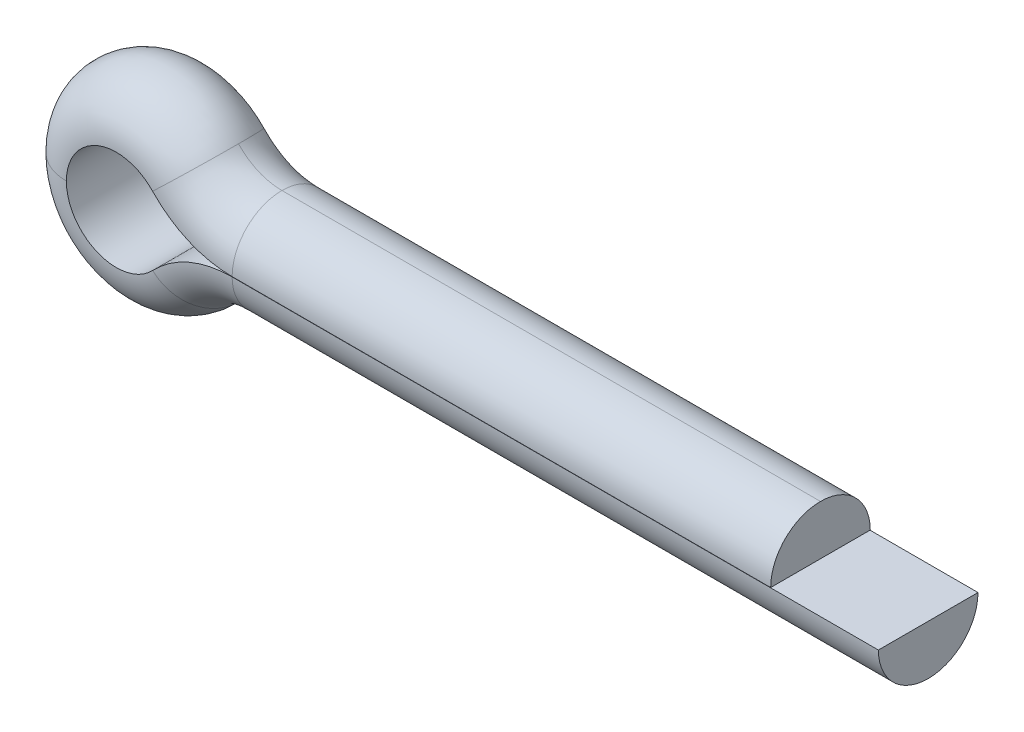
ISO-10303-21;
HEADER;
FILE_DESCRIPTION(('STEP AP214'),'2;1');
FILE_NAME('part.step','',(''),(''),'','','');
FILE_SCHEMA(('AUTOMOTIVE_DESIGN { 1 0 10303 214 1 1 1 1 }'));
ENDSEC;
DATA;
#1=APPLICATION_CONTEXT('core data for automotive mechanical design processes');
#2=APPLICATION_PROTOCOL_DEFINITION('international standard','automotive_design',2000,#1);
#3=PRODUCT_CONTEXT('',#1,'mechanical');
#4=PRODUCT('Part','Part','',(#3));
#5=PRODUCT_RELATED_PRODUCT_CATEGORY('part','',(#4));
#6=PRODUCT_DEFINITION_FORMATION('','',#4);
#7=PRODUCT_DEFINITION_CONTEXT('part definition',#1,'design');
#8=PRODUCT_DEFINITION('design','',#6,#7);
#9=PRODUCT_DEFINITION_SHAPE('','',#8);
#10=(LENGTH_UNIT() NAMED_UNIT(*) SI_UNIT(.MILLI.,.METRE.));
#11=(NAMED_UNIT(*) PLANE_ANGLE_UNIT() SI_UNIT($,.RADIAN.));
#12=(NAMED_UNIT(*) SI_UNIT($,.STERADIAN.) SOLID_ANGLE_UNIT());
#13=UNCERTAINTY_MEASURE_WITH_UNIT(LENGTH_MEASURE(1.E-05),#10,'distance_accuracy_value','');
#14=(GEOMETRIC_REPRESENTATION_CONTEXT(3) GLOBAL_UNCERTAINTY_ASSIGNED_CONTEXT((#13)) GLOBAL_UNIT_ASSIGNED_CONTEXT((#10,
#11,#12)) REPRESENTATION_CONTEXT('',''));
#15=CARTESIAN_POINT('',(0.,0.,0.));
#16=DIRECTION('',(0.,0.,1.));
#17=DIRECTION('',(1.,0.,0.));
#18=AXIS2_PLACEMENT_3D('',#15,#16,#17);
#19=CARTESIAN_POINT('',(32.,0.,0.));
#20=DIRECTION('',(-1.,0.,0.));
#21=DIRECTION('',(0.,1.,0.));
#22=AXIS2_PLACEMENT_3D('',#19,#20,#21);
#23=PLANE('',#22);
#24=CARTESIAN_POINT('',(32.,0.,0.));
#25=DIRECTION('',(-1.,0.,0.));
#26=DIRECTION('',(0.,0.,-1.));
#27=AXIS2_PLACEMENT_3D('',#24,#25,#26);
#28=CIRCLE('',#27,1.85);
#29=CARTESIAN_POINT('',(32.,-0.00499999999999806,-1.8499932432309));
#30=VERTEX_POINT('',#29);
#31=CARTESIAN_POINT('',(32.,-0.00499999999999806,1.8499932432309));
#32=VERTEX_POINT('',#31);
#33=EDGE_CURVE('E27',#30,#32,#28,.T.);
#34=ORIENTED_EDGE('',*,*,#33,.F.);
#35=DIRECTION('',(0.,0.,-1.));
#36=VECTOR('',#35,1.);
#37=CARTESIAN_POINT('',(32.,-0.00499999999999806,-1.8499932432309));
#38=LINE('',#37,#36);
#39=EDGE_CURVE('E42',#32,#30,#38,.T.);
#40=ORIENTED_EDGE('',*,*,#39,.F.);
#41=EDGE_LOOP('',(#34,#40));
#42=FACE_BOUND('',#41,.T.);
#43=ADVANCED_FACE('F16',(#42),#23,.F.);
#44=CARTESIAN_POINT('',(8.,0.,0.));
#45=DIRECTION('',(1.,0.,0.));
#46=DIRECTION('',(0.,1.,0.));
#47=AXIS2_PLACEMENT_3D('',#44,#45,#46);
#48=CYLINDRICAL_SURFACE('',#47,1.85);
#49=CARTESIAN_POINT('',(8.,0.,0.));
#50=DIRECTION('',(-1.,0.,0.));
#51=DIRECTION('',(0.,0.,-1.));
#52=AXIS2_PLACEMENT_3D('',#49,#50,#51);
#53=CIRCLE('',#52,1.85);
#54=CARTESIAN_POINT('',(8.,-0.00500000000000066,-1.8499932432309));
#55=VERTEX_POINT('',#54);
#56=CARTESIAN_POINT('',(8.,-1.85,0.));
#57=VERTEX_POINT('',#56);
#58=EDGE_CURVE('E143',#55,#57,#53,.T.);
#59=ORIENTED_EDGE('',*,*,#58,.F.);
#60=DIRECTION('',(1.,0.,0.));
#61=VECTOR('',#60,1.);
#62=CARTESIAN_POINT('',(8.,-0.00500000000000066,-1.8499932432309));
#63=LINE('',#62,#61);
#64=EDGE_CURVE('E11',#55,#30,#63,.T.);
#65=ORIENTED_EDGE('',*,*,#64,.T.);
#66=ORIENTED_EDGE('',*,*,#33,.T.);
#67=DIRECTION('',(1.,0.,0.));
#68=VECTOR('',#67,1.);
#69=CARTESIAN_POINT('',(8.,-0.00500000000000066,1.8499932432309));
#70=LINE('',#69,#68);
#71=CARTESIAN_POINT('',(8.,-0.00500000000000066,1.8499932432309));
#72=VERTEX_POINT('',#71);
#73=EDGE_CURVE('E113',#72,#32,#70,.T.);
#74=ORIENTED_EDGE('',*,*,#73,.F.);
#75=CARTESIAN_POINT('',(8.,0.,0.));
#76=DIRECTION('',(-1.,0.,0.));
#77=DIRECTION('',(0.,0.,-1.));
#78=AXIS2_PLACEMENT_3D('',#75,#76,#77);
#79=CIRCLE('',#78,1.85);
#80=EDGE_CURVE('E126',#57,#72,#79,.T.);
#81=ORIENTED_EDGE('',*,*,#80,.F.);
#82=EDGE_LOOP('',(#59,#65,#66,#74,#81));
#83=FACE_BOUND('',#82,.T.);
#84=ADVANCED_FACE('F136',(#83),#48,.T.);
#85=CARTESIAN_POINT('',(8.,-0.00500000000000066,-1.8499932432309));
#86=DIRECTION('',(0.,-1.,0.));
#87=DIRECTION('',(0.,0.,-1.));
#88=AXIS2_PLACEMENT_3D('',#85,#86,#87);
#89=PLANE('',#88);
#90=DIRECTION('',(0.,0.,-1.));
#91=VECTOR('',#90,1.);
#92=CARTESIAN_POINT('',(8.,-0.00500000000000066,-1.8499932432309));
#93=LINE('',#92,#91);
#94=EDGE_CURVE('E109',#72,#55,#93,.T.);
#95=ORIENTED_EDGE('',*,*,#94,.F.);
#96=ORIENTED_EDGE('',*,*,#73,.T.);
#97=ORIENTED_EDGE('',*,*,#39,.T.);
#98=ORIENTED_EDGE('',*,*,#64,.F.);
#99=EDGE_LOOP('',(#95,#96,#97,#98));
#100=FACE_BOUND('',#99,.T.);
#101=ADVANCED_FACE('F111',(#100),#89,.F.);
#102=CARTESIAN_POINT('',(8.,-4.07229729729729,0.));
#103=DIRECTION('',(0.,0.,-1.));
#104=DIRECTION('',(-1.,0.,0.));
#105=AXIS2_PLACEMENT_3D('',#102,#103,#104);
#106=TOROIDAL_SURFACE('',#105,4.07229729729729,1.85);
#107=CARTESIAN_POINT('',(5.04322875071308,-1.27209925841413,0.));
#108=DIRECTION('',(-0.687621220764393,-0.726069594980044,0.));
#109=DIRECTION('',(0.,0.,-1.));
#110=AXIS2_PLACEMENT_3D('',#107,#108,#109);
#111=CIRCLE('',#110,1.85);
#112=CARTESIAN_POINT('',(6.38645750142616,-2.54419851682826,0.));
#113=VERTEX_POINT('',#112);
#114=CARTESIAN_POINT('',(5.04685909868798,-1.27553736451795,1.8499932432309));
#115=VERTEX_POINT('',#114);
#116=EDGE_CURVE('E163',#113,#115,#111,.T.);
#117=ORIENTED_EDGE('',*,*,#116,.F.);
#118=CARTESIAN_POINT('',(8.,-4.07229729729729,0.));
#119=DIRECTION('',(0.,0.,-1.));
#120=DIRECTION('',(-1.,0.,0.));
#121=AXIS2_PLACEMENT_3D('',#118,#119,#120);
#122=CIRCLE('',#121,2.22229729729729);
#123=EDGE_CURVE('E130',#113,#57,#122,.T.);
#124=ORIENTED_EDGE('',*,*,#123,.T.);
#125=ORIENTED_EDGE('',*,*,#80,.T.);
#126=CARTESIAN_POINT('',(8.,-4.07229729729729,1.8499932432309));
#127=DIRECTION('',(0.,0.,-1.));
#128=DIRECTION('',(-1.,0.,0.));
#129=AXIS2_PLACEMENT_3D('',#126,#127,#128);
#130=CIRCLE('',#129,4.06729729729729);
#131=EDGE_CURVE('E120',#115,#72,#130,.T.);
#132=ORIENTED_EDGE('',*,*,#131,.F.);
#133=EDGE_LOOP('',(#117,#124,#125,#132));
#134=FACE_BOUND('',#133,.T.);
#135=ADVANCED_FACE('F127',(#134),#106,.T.);
#136=CARTESIAN_POINT('',(8.,-4.07229729729729,0.));
#137=DIRECTION('',(0.,0.,-1.));
#138=DIRECTION('',(-1.,0.,0.));
#139=AXIS2_PLACEMENT_3D('',#136,#137,#138);
#140=TOROIDAL_SURFACE('',#139,4.07229729729729,1.85);
#141=ORIENTED_EDGE('',*,*,#123,.F.);
#142=CARTESIAN_POINT('',(5.04322875071308,-1.27209925841413,0.));
#143=DIRECTION('',(-0.687621220764393,-0.726069594980044,0.));
#144=DIRECTION('',(0.,0.,-1.));
#145=AXIS2_PLACEMENT_3D('',#142,#143,#144);
#146=CIRCLE('',#145,1.85);
#147=CARTESIAN_POINT('',(5.04685909868798,-1.27553736451795,-1.8499932432309));
#148=VERTEX_POINT('',#147);
#149=EDGE_CURVE('E20',#148,#113,#146,.T.);
#150=ORIENTED_EDGE('',*,*,#149,.F.);
#151=CARTESIAN_POINT('',(8.,-4.07229729729729,-1.8499932432309));
#152=DIRECTION('',(0.,0.,-1.));
#153=DIRECTION('',(-1.,0.,0.));
#154=AXIS2_PLACEMENT_3D('',#151,#152,#153);
#155=CIRCLE('',#154,4.06729729729729);
#156=EDGE_CURVE('E133',#148,#55,#155,.T.);
#157=ORIENTED_EDGE('',*,*,#156,.T.);
#158=ORIENTED_EDGE('',*,*,#58,.T.);
#159=EDGE_LOOP('',(#141,#150,#157,#158));
#160=FACE_BOUND('',#159,.T.);
#161=ADVANCED_FACE('F356',(#160),#140,.T.);
#162=CARTESIAN_POINT('',(8.,-4.07229729729729,0.));
#163=DIRECTION('',(0.,0.,-1.));
#164=DIRECTION('',(-1.,0.,0.));
#165=AXIS2_PLACEMENT_3D('',#162,#163,#164);
#166=CYLINDRICAL_SURFACE('',#165,4.06729729729729);
#167=DIRECTION('',(0.,0.,-1.));
#168=VECTOR('',#167,1.);
#169=CARTESIAN_POINT('',(5.04685909868798,-1.27553736451795,-1.8499932432309));
#170=LINE('',#169,#168);
#171=EDGE_CURVE('E140',#115,#148,#170,.T.);
#172=ORIENTED_EDGE('',*,*,#171,.F.);
#173=ORIENTED_EDGE('',*,*,#131,.T.);
#174=ORIENTED_EDGE('',*,*,#94,.T.);
#175=ORIENTED_EDGE('',*,*,#156,.F.);
#176=EDGE_LOOP('',(#172,#173,#174,#175));
#177=FACE_BOUND('',#176,.T.);
#178=ADVANCED_FACE('F139',(#177),#166,.T.);
#179=CARTESIAN_POINT('',(3.7,0.,0.));
#180=DIRECTION('',(0.,0.,1.));
#181=DIRECTION('',(1.,0.,0.));
#182=AXIS2_PLACEMENT_3D('',#179,#180,#181);
#183=DEGENERATE_TOROIDAL_SURFACE('',#182,1.85,1.85,.T.);
#184=CARTESIAN_POINT('',(1.85,0.,0.));
#185=DIRECTION('',(0.,1.,0.));
#186=DIRECTION('',(-1.,0.,0.));
#187=AXIS2_PLACEMENT_3D('',#184,#185,#186);
#188=CIRCLE('',#187,1.85);
#189=CARTESIAN_POINT('',(1.845,0.,-1.8499932432309));
#190=VERTEX_POINT('',#189);
#191=CARTESIAN_POINT('',(1.845,0.,1.8499932432309));
#192=VERTEX_POINT('',#191);
#193=EDGE_CURVE('E182',#190,#192,#188,.T.);
#194=ORIENTED_EDGE('',*,*,#193,.F.);
#195=CARTESIAN_POINT('',(3.7,0.,-1.8499932432309));
#196=DIRECTION('',(0.,0.,1.));
#197=DIRECTION('',(1.,0.,0.));
#198=AXIS2_PLACEMENT_3D('',#195,#196,#197);
#199=CIRCLE('',#198,1.855);
#200=EDGE_CURVE('E121',#190,#148,#199,.T.);
#201=ORIENTED_EDGE('',*,*,#200,.T.);
#202=ORIENTED_EDGE('',*,*,#149,.T.);
#203=ORIENTED_EDGE('',*,*,#116,.T.);
#204=CARTESIAN_POINT('',(3.7,0.,1.8499932432309));
#205=DIRECTION('',(0.,0.,1.));
#206=DIRECTION('',(1.,0.,0.));
#207=AXIS2_PLACEMENT_3D('',#204,#205,#206);
#208=CIRCLE('',#207,1.855);
#209=EDGE_CURVE('E156',#192,#115,#208,.T.);
#210=ORIENTED_EDGE('',*,*,#209,.F.);
#211=EDGE_LOOP('',(#194,#201,#202,#203,#210));
#212=FACE_BOUND('',#211,.T.);
#213=ADVANCED_FACE('F323',(#212),#183,.T.);
#214=CARTESIAN_POINT('',(3.7,0.,0.));
#215=DIRECTION('',(0.,0.,1.));
#216=DIRECTION('',(1.,0.,0.));
#217=AXIS2_PLACEMENT_3D('',#214,#215,#216);
#218=CYLINDRICAL_SURFACE('',#217,1.855);
#219=DIRECTION('',(0.,0.,-1.));
#220=VECTOR('',#219,1.);
#221=CARTESIAN_POINT('',(5.04685909868797,1.27553736451797,-1.8499932432309));
#222=LINE('',#221,#220);
#223=CARTESIAN_POINT('',(5.04685909868797,1.27553736451797,1.8499932432309));
#224=VERTEX_POINT('',#223);
#225=CARTESIAN_POINT('',(5.04685909868797,1.27553736451797,-1.8499932432309));
#226=VERTEX_POINT('',#225);
#227=EDGE_CURVE('E168',#224,#226,#222,.T.);
#228=ORIENTED_EDGE('',*,*,#227,.F.);
#229=CARTESIAN_POINT('',(3.7,0.,1.8499932432309));
#230=DIRECTION('',(0.,0.,1.));
#231=DIRECTION('',(1.,0.,0.));
#232=AXIS2_PLACEMENT_3D('',#229,#230,#231);
#233=CIRCLE('',#232,1.855);
#234=EDGE_CURVE('E159',#224,#192,#233,.T.);
#235=ORIENTED_EDGE('',*,*,#234,.T.);
#236=ORIENTED_EDGE('',*,*,#209,.T.);
#237=ORIENTED_EDGE('',*,*,#171,.T.);
#238=ORIENTED_EDGE('',*,*,#200,.F.);
#239=CARTESIAN_POINT('',(3.7,0.,-1.8499932432309));
#240=DIRECTION('',(0.,0.,1.));
#241=DIRECTION('',(1.,0.,0.));
#242=AXIS2_PLACEMENT_3D('',#239,#240,#241);
#243=CIRCLE('',#242,1.855);
#244=EDGE_CURVE('E189',#226,#190,#243,.T.);
#245=ORIENTED_EDGE('',*,*,#244,.F.);
#246=EDGE_LOOP('',(#228,#235,#236,#237,#238,#245));
#247=FACE_BOUND('',#246,.T.);
#248=ADVANCED_FACE('F314',(#247),#218,.F.);
#249=CARTESIAN_POINT('',(3.7,0.,0.));
#250=DIRECTION('',(0.,0.,1.));
#251=DIRECTION('',(1.,0.,0.));
#252=AXIS2_PLACEMENT_3D('',#249,#250,#251);
#253=DEGENERATE_TOROIDAL_SURFACE('',#252,1.85,1.85,.T.);
#254=ORIENTED_EDGE('',*,*,#244,.T.);
#255=ORIENTED_EDGE('',*,*,#193,.T.);
#256=ORIENTED_EDGE('',*,*,#234,.F.);
#257=CARTESIAN_POINT('',(5.04322875071307,1.27209925841415,0.));
#258=DIRECTION('',(0.687621220764404,-0.726069594980034,0.));
#259=DIRECTION('',(0.,0.,-1.));
#260=AXIS2_PLACEMENT_3D('',#257,#258,#259);
#261=CIRCLE('',#260,1.85);
#262=CARTESIAN_POINT('',(6.38645750142613,2.54419851682829,0.));
#263=VERTEX_POINT('',#262);
#264=EDGE_CURVE('E236',#263,#224,#261,.T.);
#265=ORIENTED_EDGE('',*,*,#264,.F.);
#266=CARTESIAN_POINT('',(5.04322875071307,1.27209925841415,0.));
#267=DIRECTION('',(0.687621220764404,-0.726069594980034,0.));
#268=DIRECTION('',(0.,0.,-1.));
#269=AXIS2_PLACEMENT_3D('',#266,#267,#268);
#270=CIRCLE('',#269,1.85);
#271=EDGE_CURVE('E169',#226,#263,#270,.T.);
#272=ORIENTED_EDGE('',*,*,#271,.F.);
#273=EDGE_LOOP('',(#254,#255,#256,#265,#272));
#274=FACE_BOUND('',#273,.T.);
#275=ADVANCED_FACE('F309',(#274),#253,.T.);
#276=CARTESIAN_POINT('',(8.,4.0722972972973,0.));
#277=DIRECTION('',(0.,0.,-1.));
#278=DIRECTION('',(-1.,0.,0.));
#279=AXIS2_PLACEMENT_3D('',#276,#277,#278);
#280=CYLINDRICAL_SURFACE('',#279,4.0672972972973);
#281=DIRECTION('',(0.,0.,-1.));
#282=VECTOR('',#281,1.);
#283=CARTESIAN_POINT('',(8.,0.00500000000000088,-1.8499932432309));
#284=LINE('',#283,#282);
#285=CARTESIAN_POINT('',(8.,0.00500000000000085,1.8499932432309));
#286=VERTEX_POINT('',#285);
#287=CARTESIAN_POINT('',(8.,0.00500000000000088,-1.8499932432309));
#288=VERTEX_POINT('',#287);
#289=EDGE_CURVE('E210',#286,#288,#284,.T.);
#290=ORIENTED_EDGE('',*,*,#289,.F.);
#291=CARTESIAN_POINT('',(8.,4.0722972972973,1.8499932432309));
#292=DIRECTION('',(0.,0.,-1.));
#293=DIRECTION('',(-1.,0.,0.));
#294=AXIS2_PLACEMENT_3D('',#291,#292,#293);
#295=CIRCLE('',#294,4.0672972972973);
#296=EDGE_CURVE('E178',#286,#224,#295,.T.);
#297=ORIENTED_EDGE('',*,*,#296,.T.);
#298=ORIENTED_EDGE('',*,*,#227,.T.);
#299=CARTESIAN_POINT('',(8.,4.0722972972973,-1.8499932432309));
#300=DIRECTION('',(0.,0.,-1.));
#301=DIRECTION('',(-1.,0.,0.));
#302=AXIS2_PLACEMENT_3D('',#299,#300,#301);
#303=CIRCLE('',#302,4.0672972972973);
#304=EDGE_CURVE('E164',#288,#226,#303,.T.);
#305=ORIENTED_EDGE('',*,*,#304,.F.);
#306=EDGE_LOOP('',(#290,#297,#298,#305));
#307=FACE_BOUND('',#306,.T.);
#308=ADVANCED_FACE('F313',(#307),#280,.T.);
#309=CARTESIAN_POINT('',(8.,4.0722972972973,0.));
#310=DIRECTION('',(0.,0.,-1.));
#311=DIRECTION('',(-1.,0.,0.));
#312=AXIS2_PLACEMENT_3D('',#309,#310,#311);
#313=TOROIDAL_SURFACE('',#312,4.0722972972973,1.85);
#314=CARTESIAN_POINT('',(8.,4.0722972972973,0.));
#315=DIRECTION('',(0.,0.,-1.));
#316=DIRECTION('',(-1.,0.,0.));
#317=AXIS2_PLACEMENT_3D('',#314,#315,#316);
#318=CIRCLE('',#317,2.2222972972973);
#319=CARTESIAN_POINT('',(8.,1.85,0.));
#320=VERTEX_POINT('',#319);
#321=EDGE_CURVE('E233',#320,#263,#318,.T.);
#322=ORIENTED_EDGE('',*,*,#321,.F.);
#323=CARTESIAN_POINT('',(8.,0.,0.));
#324=DIRECTION('',(1.,0.,0.));
#325=DIRECTION('',(0.,0.,-1.));
#326=AXIS2_PLACEMENT_3D('',#323,#324,#325);
#327=CIRCLE('',#326,1.85);
#328=EDGE_CURVE('E217',#288,#320,#327,.T.);
#329=ORIENTED_EDGE('',*,*,#328,.F.);
#330=ORIENTED_EDGE('',*,*,#304,.T.);
#331=ORIENTED_EDGE('',*,*,#271,.T.);
#332=EDGE_LOOP('',(#322,#329,#330,#331));
#333=FACE_BOUND('',#332,.T.);
#334=ADVANCED_FACE('F343',(#333),#313,.T.);
#335=CARTESIAN_POINT('',(8.,4.0722972972973,0.));
#336=DIRECTION('',(0.,0.,-1.));
#337=DIRECTION('',(-1.,0.,0.));
#338=AXIS2_PLACEMENT_3D('',#335,#336,#337);
#339=TOROIDAL_SURFACE('',#338,4.0722972972973,1.85);
#340=CARTESIAN_POINT('',(8.,0.,0.));
#341=DIRECTION('',(1.,0.,0.));
#342=DIRECTION('',(0.,0.,-1.));
#343=AXIS2_PLACEMENT_3D('',#340,#341,#342);
#344=CIRCLE('',#343,1.85);
#345=EDGE_CURVE('E186',#320,#286,#344,.T.);
#346=ORIENTED_EDGE('',*,*,#345,.F.);
#347=ORIENTED_EDGE('',*,*,#321,.T.);
#348=ORIENTED_EDGE('',*,*,#264,.T.);
#349=ORIENTED_EDGE('',*,*,#296,.F.);
#350=EDGE_LOOP('',(#346,#347,#348,#349));
#351=FACE_BOUND('',#350,.T.);
#352=ADVANCED_FACE('F347',(#351),#339,.T.);
#353=CARTESIAN_POINT('',(8.,0.00500000000000088,-1.8499932432309));
#354=DIRECTION('',(0.,-1.,0.));
#355=DIRECTION('',(-1.,0.,0.));
#356=AXIS2_PLACEMENT_3D('',#353,#354,#355);
#357=PLANE('',#356);
#358=DIRECTION('',(0.,0.,-1.));
#359=VECTOR('',#358,1.);
#360=CARTESIAN_POINT('',(28.,0.00500000000000066,-1.8499932432309));
#361=LINE('',#360,#359);
#362=CARTESIAN_POINT('',(28.,0.00500000000000064,1.8499932432309));
#363=VERTEX_POINT('',#362);
#364=CARTESIAN_POINT('',(28.,0.00500000000000066,-1.8499932432309));
#365=VERTEX_POINT('',#364);
#366=EDGE_CURVE('E170',#363,#365,#361,.T.);
#367=ORIENTED_EDGE('',*,*,#366,.F.);
#368=DIRECTION('',(1.,0.,0.));
#369=VECTOR('',#368,1.);
#370=CARTESIAN_POINT('',(8.,0.00500000000000085,1.8499932432309));
#371=LINE('',#370,#369);
#372=EDGE_CURVE('E176',#286,#363,#371,.T.);
#373=ORIENTED_EDGE('',*,*,#372,.F.);
#374=ORIENTED_EDGE('',*,*,#289,.T.);
#375=DIRECTION('',(1.,0.,0.));
#376=VECTOR('',#375,1.);
#377=CARTESIAN_POINT('',(8.,0.00500000000000088,-1.8499932432309));
#378=LINE('',#377,#376);
#379=EDGE_CURVE('E213',#288,#365,#378,.T.);
#380=ORIENTED_EDGE('',*,*,#379,.T.);
#381=EDGE_LOOP('',(#367,#373,#374,#380));
#382=FACE_BOUND('',#381,.T.);
#383=ADVANCED_FACE('F209',(#382),#357,.T.);
#384=CARTESIAN_POINT('',(8.,0.,0.));
#385=DIRECTION('',(1.,0.,0.));
#386=DIRECTION('',(0.,1.,0.));
#387=AXIS2_PLACEMENT_3D('',#384,#385,#386);
#388=CYLINDRICAL_SURFACE('',#387,1.85);
#389=ORIENTED_EDGE('',*,*,#328,.T.);
#390=DIRECTION('',(1.,0.,0.));
#391=VECTOR('',#390,1.);
#392=CARTESIAN_POINT('',(8.,1.85,0.));
#393=LINE('',#392,#391);
#394=CARTESIAN_POINT('',(28.,1.85,0.));
#395=VERTEX_POINT('',#394);
#396=EDGE_CURVE('E204',#320,#395,#393,.T.);
#397=ORIENTED_EDGE('',*,*,#396,.T.);
#398=CARTESIAN_POINT('',(28.,0.,0.));
#399=DIRECTION('',(1.,0.,0.));
#400=DIRECTION('',(0.,0.,-1.));
#401=AXIS2_PLACEMENT_3D('',#398,#399,#400);
#402=CIRCLE('',#401,1.85);
#403=EDGE_CURVE('E174',#365,#395,#402,.T.);
#404=ORIENTED_EDGE('',*,*,#403,.F.);
#405=ORIENTED_EDGE('',*,*,#379,.F.);
#406=EDGE_LOOP('',(#389,#397,#404,#405));
#407=FACE_BOUND('',#406,.T.);
#408=ADVANCED_FACE('F219',(#407),#388,.T.);
#409=CARTESIAN_POINT('',(8.,0.,0.));
#410=DIRECTION('',(1.,0.,0.));
#411=DIRECTION('',(0.,1.,0.));
#412=AXIS2_PLACEMENT_3D('',#409,#410,#411);
#413=CYLINDRICAL_SURFACE('',#412,1.85);
#414=ORIENTED_EDGE('',*,*,#396,.F.);
#415=ORIENTED_EDGE('',*,*,#345,.T.);
#416=ORIENTED_EDGE('',*,*,#372,.T.);
#417=CARTESIAN_POINT('',(28.,0.,0.));
#418=DIRECTION('',(1.,0.,0.));
#419=DIRECTION('',(0.,0.,-1.));
#420=AXIS2_PLACEMENT_3D('',#417,#418,#419);
#421=CIRCLE('',#420,1.85);
#422=EDGE_CURVE('E173',#395,#363,#421,.T.);
#423=ORIENTED_EDGE('',*,*,#422,.F.);
#424=EDGE_LOOP('',(#414,#415,#416,#423));
#425=FACE_BOUND('',#424,.T.);
#426=ADVANCED_FACE('F203',(#425),#413,.T.);
#427=CARTESIAN_POINT('',(28.,0.,0.));
#428=DIRECTION('',(1.,0.,0.));
#429=DIRECTION('',(0.,1.,0.));
#430=AXIS2_PLACEMENT_3D('',#427,#428,#429);
#431=PLANE('',#430);
#432=ORIENTED_EDGE('',*,*,#403,.T.);
#433=ORIENTED_EDGE('',*,*,#422,.T.);
#434=ORIENTED_EDGE('',*,*,#366,.T.);
#435=EDGE_LOOP('',(#432,#433,#434));
#436=FACE_BOUND('',#435,.T.);
#437=ADVANCED_FACE('F18',(#436),#431,.T.);
#438=CLOSED_SHELL('',(#43,#84,#101,#135,#161,#178,#213,#248,#275,#308,#334,#352,#383,#408,#426,#437));
#439=MANIFOLD_SOLID_BREP('B1',#438);
#440=ADVANCED_BREP_SHAPE_REPRESENTATION('',(#18,#439),#14);
#441=SHAPE_DEFINITION_REPRESENTATION(#9,#440);
ENDSEC;
END-ISO-10303-21;
